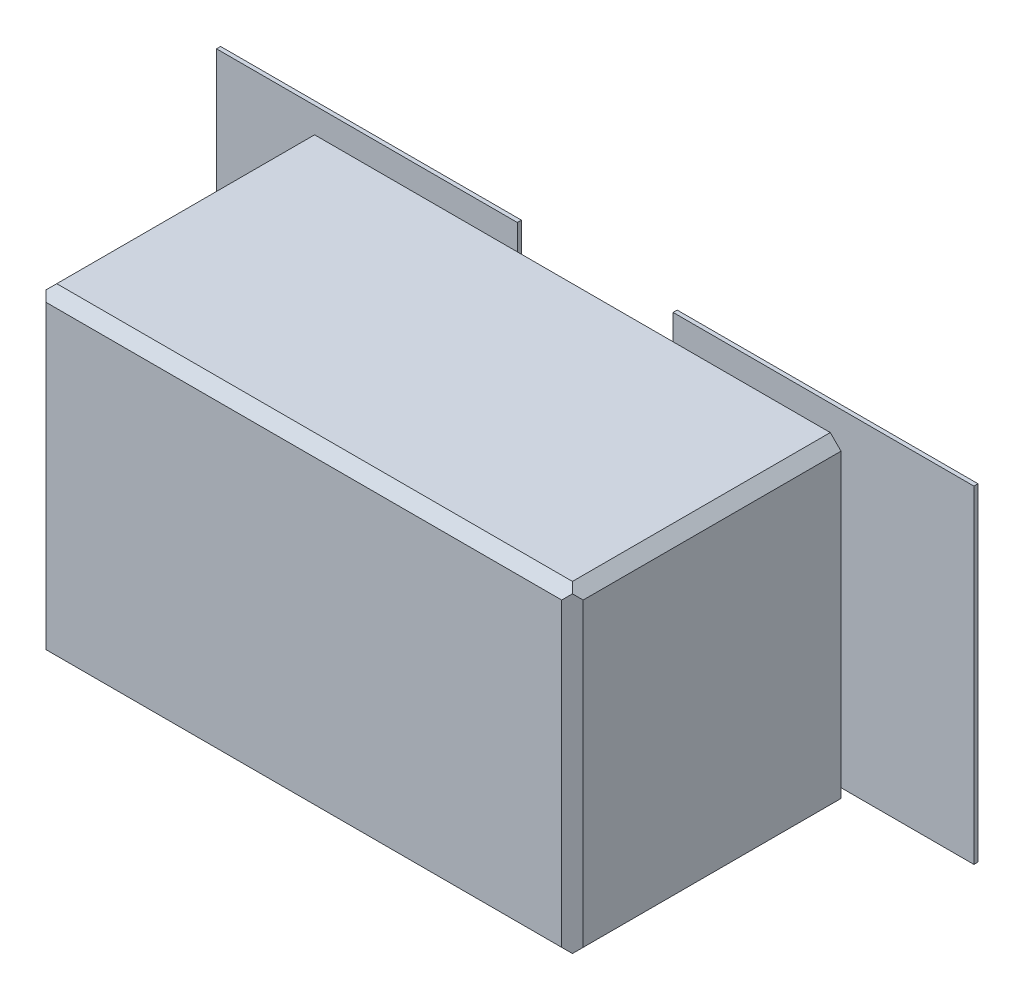
ISO-10303-21;
HEADER;
FILE_DESCRIPTION(('STEP AP214'),'2;1');
FILE_NAME('part.step','',(''),(''),'','','');
FILE_SCHEMA(('AUTOMOTIVE_DESIGN { 1 0 10303 214 1 1 1 1 }'));
ENDSEC;
DATA;
#1=APPLICATION_CONTEXT('core data for automotive mechanical design processes');
#2=APPLICATION_PROTOCOL_DEFINITION('international standard','automotive_design',2000,#1);
#3=PRODUCT_CONTEXT('',#1,'mechanical');
#4=PRODUCT('Part','Part','',(#3));
#5=PRODUCT_RELATED_PRODUCT_CATEGORY('part','',(#4));
#6=PRODUCT_DEFINITION_FORMATION('','',#4);
#7=PRODUCT_DEFINITION_CONTEXT('part definition',#1,'design');
#8=PRODUCT_DEFINITION('design','',#6,#7);
#9=PRODUCT_DEFINITION_SHAPE('','',#8);
#10=(LENGTH_UNIT() NAMED_UNIT(*) SI_UNIT(.MILLI.,.METRE.));
#11=(NAMED_UNIT(*) PLANE_ANGLE_UNIT() SI_UNIT($,.RADIAN.));
#12=(NAMED_UNIT(*) SI_UNIT($,.STERADIAN.) SOLID_ANGLE_UNIT());
#13=UNCERTAINTY_MEASURE_WITH_UNIT(LENGTH_MEASURE(1.E-05),#10,'distance_accuracy_value','');
#14=(GEOMETRIC_REPRESENTATION_CONTEXT(3) GLOBAL_UNCERTAINTY_ASSIGNED_CONTEXT((#13)) GLOBAL_UNIT_ASSIGNED_CONTEXT((#10,
#11,#12)) REPRESENTATION_CONTEXT('',''));
#15=CARTESIAN_POINT('',(0.,0.,0.));
#16=DIRECTION('',(0.,0.,1.));
#17=DIRECTION('',(1.,0.,0.));
#18=AXIS2_PLACEMENT_3D('',#15,#16,#17);
#19=CARTESIAN_POINT('',(-0.49,0.,0.6162));
#20=DIRECTION('',(-0.707106781186548,0.,0.707106781186548));
#21=DIRECTION('',(0.,1.,0.));
#22=AXIS2_PLACEMENT_3D('',#19,#20,#21);
#23=PLANE('',#22);
#24=DIRECTION('',(-0.577350269189626,0.577350269189626,-0.577350269189626));
#25=VECTOR('',#24,1.);
#26=CARTESIAN_POINT('',(-0.49,-0.29,0.6162));
#27=LINE('',#26,#25);
#28=CARTESIAN_POINT('',(-0.49,-0.29,0.6162));
#29=VERTEX_POINT('',#28);
#30=CARTESIAN_POINT('',(-0.5,-0.28,0.6062));
#31=VERTEX_POINT('',#30);
#32=EDGE_CURVE('P0_E236',#29,#31,#27,.T.);
#33=ORIENTED_EDGE('',*,*,#32,.F.);
#34=DIRECTION('',(-0.577350269189626,-0.577350269189626,-0.577350269189626));
#35=VECTOR('',#34,1.);
#36=CARTESIAN_POINT('',(-0.48,-0.28,0.6262));
#37=LINE('',#36,#35);
#38=CARTESIAN_POINT('',(-0.48,-0.28,0.6262));
#39=VERTEX_POINT('',#38);
#40=EDGE_CURVE('P0_E11',#39,#29,#37,.T.);
#41=ORIENTED_EDGE('',*,*,#40,.F.);
#42=DIRECTION('',(0.,-1.,0.));
#43=VECTOR('',#42,1.);
#44=CARTESIAN_POINT('',(-0.48,0.28,0.6262));
#45=LINE('',#44,#43);
#46=CARTESIAN_POINT('',(-0.48,0.28,0.6262));
#47=VERTEX_POINT('',#46);
#48=EDGE_CURVE('P0_E294',#47,#39,#45,.T.);
#49=ORIENTED_EDGE('',*,*,#48,.F.);
#50=DIRECTION('',(0.577350269189626,-0.577350269189626,0.577350269189626));
#51=VECTOR('',#50,1.);
#52=CARTESIAN_POINT('',(-0.49,0.29,0.6162));
#53=LINE('',#52,#51);
#54=CARTESIAN_POINT('',(-0.49,0.29,0.6162));
#55=VERTEX_POINT('',#54);
#56=EDGE_CURVE('P0_E307',#55,#47,#53,.T.);
#57=ORIENTED_EDGE('',*,*,#56,.F.);
#58=DIRECTION('',(0.577350269189626,0.577350269189626,0.577350269189626));
#59=VECTOR('',#58,1.);
#60=CARTESIAN_POINT('',(-0.5,0.28,0.6062));
#61=LINE('',#60,#59);
#62=CARTESIAN_POINT('',(-0.5,0.28,0.6062));
#63=VERTEX_POINT('',#62);
#64=EDGE_CURVE('P0_E369',#63,#55,#61,.T.);
#65=ORIENTED_EDGE('',*,*,#64,.F.);
#66=DIRECTION('',(0.,-1.,0.));
#67=VECTOR('',#66,1.);
#68=CARTESIAN_POINT('',(-0.5,0.28,0.6062));
#69=LINE('',#68,#67);
#70=EDGE_CURVE('P0_E235',#63,#31,#69,.T.);
#71=ORIENTED_EDGE('',*,*,#70,.T.);
#72=EDGE_LOOP('',(#33,#41,#49,#57,#65,#71));
#73=FACE_BOUND('',#72,.T.);
#74=ADVANCED_FACE('P0_F18',(#73),#23,.T.);
#75=CARTESIAN_POINT('',(0.,-0.29,0.6162));
#76=DIRECTION('',(0.,-0.707106781186548,0.707106781186548));
#77=DIRECTION('',(-1.,0.,0.));
#78=AXIS2_PLACEMENT_3D('',#75,#76,#77);
#79=PLANE('',#78);
#80=DIRECTION('',(-0.577350269189626,-0.577350269189626,-0.577350269189626));
#81=VECTOR('',#80,1.);
#82=CARTESIAN_POINT('',(0.49,-0.29,0.6162));
#83=LINE('',#82,#81);
#84=CARTESIAN_POINT('',(0.49,-0.29,0.6162));
#85=VERTEX_POINT('',#84);
#86=CARTESIAN_POINT('',(0.48,-0.3,0.6062));
#87=VERTEX_POINT('',#86);
#88=EDGE_CURVE('P0_E231',#85,#87,#83,.T.);
#89=ORIENTED_EDGE('',*,*,#88,.F.);
#90=DIRECTION('',(0.577350269189626,-0.577350269189626,-0.577350269189626));
#91=VECTOR('',#90,1.);
#92=CARTESIAN_POINT('',(0.48,-0.28,0.6262));
#93=LINE('',#92,#91);
#94=CARTESIAN_POINT('',(0.48,-0.28,0.6262));
#95=VERTEX_POINT('',#94);
#96=EDGE_CURVE('P0_E29',#95,#85,#93,.T.);
#97=ORIENTED_EDGE('',*,*,#96,.F.);
#98=DIRECTION('',(1.,0.,0.));
#99=VECTOR('',#98,1.);
#100=CARTESIAN_POINT('',(-0.48,-0.28,0.6262));
#101=LINE('',#100,#99);
#102=EDGE_CURVE('P0_E22',#39,#95,#101,.T.);
#103=ORIENTED_EDGE('',*,*,#102,.F.);
#104=ORIENTED_EDGE('',*,*,#40,.T.);
#105=DIRECTION('',(-0.577350269189626,0.577350269189626,0.577350269189626));
#106=VECTOR('',#105,1.);
#107=CARTESIAN_POINT('',(-0.48,-0.3,0.6062));
#108=LINE('',#107,#106);
#109=CARTESIAN_POINT('',(-0.48,-0.3,0.6062));
#110=VERTEX_POINT('',#109);
#111=EDGE_CURVE('P0_E354',#110,#29,#108,.T.);
#112=ORIENTED_EDGE('',*,*,#111,.F.);
#113=DIRECTION('',(1.,0.,0.));
#114=VECTOR('',#113,1.);
#115=CARTESIAN_POINT('',(-0.48,-0.3,0.6062));
#116=LINE('',#115,#114);
#117=EDGE_CURVE('P0_E230',#110,#87,#116,.T.);
#118=ORIENTED_EDGE('',*,*,#117,.T.);
#119=EDGE_LOOP('',(#89,#97,#103,#104,#112,#118));
#120=FACE_BOUND('',#119,.T.);
#121=ADVANCED_FACE('P0_F1008',(#120),#79,.T.);
#122=CARTESIAN_POINT('',(0.49,0.,0.6162));
#123=DIRECTION('',(0.707106781186548,0.,0.707106781186548));
#124=DIRECTION('',(0.,-1.,0.));
#125=AXIS2_PLACEMENT_3D('',#122,#123,#124);
#126=PLANE('',#125);
#127=DIRECTION('',(0.577350269189626,-0.577350269189626,-0.577350269189626));
#128=VECTOR('',#127,1.);
#129=CARTESIAN_POINT('',(0.49,0.29,0.6162));
#130=LINE('',#129,#128);
#131=CARTESIAN_POINT('',(0.49,0.29,0.6162));
#132=VERTEX_POINT('',#131);
#133=CARTESIAN_POINT('',(0.5,0.28,0.6062));
#134=VERTEX_POINT('',#133);
#135=EDGE_CURVE('P0_E310',#132,#134,#130,.T.);
#136=ORIENTED_EDGE('',*,*,#135,.F.);
#137=DIRECTION('',(0.577350269189626,0.577350269189626,-0.577350269189626));
#138=VECTOR('',#137,1.);
#139=CARTESIAN_POINT('',(0.48,0.28,0.6262));
#140=LINE('',#139,#138);
#141=CARTESIAN_POINT('',(0.48,0.28,0.6262));
#142=VERTEX_POINT('',#141);
#143=EDGE_CURVE('P0_E305',#142,#132,#140,.T.);
#144=ORIENTED_EDGE('',*,*,#143,.F.);
#145=DIRECTION('',(0.,1.,0.));
#146=VECTOR('',#145,1.);
#147=CARTESIAN_POINT('',(0.48,-0.28,0.6262));
#148=LINE('',#147,#146);
#149=EDGE_CURVE('P0_E278',#95,#142,#148,.T.);
#150=ORIENTED_EDGE('',*,*,#149,.F.);
#151=ORIENTED_EDGE('',*,*,#96,.T.);
#152=DIRECTION('',(-0.577350269189626,-0.577350269189626,0.577350269189626));
#153=VECTOR('',#152,1.);
#154=CARTESIAN_POINT('',(0.5,-0.28,0.6062));
#155=LINE('',#154,#153);
#156=CARTESIAN_POINT('',(0.5,-0.28,0.6062));
#157=VERTEX_POINT('',#156);
#158=EDGE_CURVE('P0_E266',#157,#85,#155,.T.);
#159=ORIENTED_EDGE('',*,*,#158,.F.);
#160=DIRECTION('',(0.,1.,0.));
#161=VECTOR('',#160,1.);
#162=CARTESIAN_POINT('',(0.5,-0.28,0.6062));
#163=LINE('',#162,#161);
#164=EDGE_CURVE('P0_E253',#157,#134,#163,.T.);
#165=ORIENTED_EDGE('',*,*,#164,.T.);
#166=EDGE_LOOP('',(#136,#144,#150,#151,#159,#165));
#167=FACE_BOUND('',#166,.T.);
#168=ADVANCED_FACE('P0_F1003',(#167),#126,.T.);
#169=CARTESIAN_POINT('',(0.,0.,0.6262));
#170=DIRECTION('',(0.,0.,1.));
#171=DIRECTION('',(1.,0.,0.));
#172=AXIS2_PLACEMENT_3D('',#169,#170,#171);
#173=PLANE('',#172);
#174=DIRECTION('',(-1.,0.,0.));
#175=VECTOR('',#174,1.);
#176=CARTESIAN_POINT('',(0.48,0.28,0.6262));
#177=LINE('',#176,#175);
#178=EDGE_CURVE('P0_E298',#142,#47,#177,.T.);
#179=ORIENTED_EDGE('',*,*,#178,.T.);
#180=ORIENTED_EDGE('',*,*,#48,.T.);
#181=ORIENTED_EDGE('',*,*,#102,.T.);
#182=ORIENTED_EDGE('',*,*,#149,.T.);
#183=EDGE_LOOP('',(#179,#180,#181,#182));
#184=FACE_BOUND('',#183,.T.);
#185=ADVANCED_FACE('P0_F857',(#184),#173,.T.);
#186=CARTESIAN_POINT('',(0.,0.29,0.6162));
#187=DIRECTION('',(0.,0.707106781186548,0.707106781186548));
#188=DIRECTION('',(1.,0.,0.));
#189=AXIS2_PLACEMENT_3D('',#186,#187,#188);
#190=PLANE('',#189);
#191=ORIENTED_EDGE('',*,*,#143,.T.);
#192=DIRECTION('',(0.577350269189626,-0.577350269189626,0.577350269189626));
#193=VECTOR('',#192,1.);
#194=CARTESIAN_POINT('',(0.48,0.3,0.6062));
#195=LINE('',#194,#193);
#196=CARTESIAN_POINT('',(0.48,0.3,0.6062));
#197=VERTEX_POINT('',#196);
#198=EDGE_CURVE('P0_E314',#197,#132,#195,.T.);
#199=ORIENTED_EDGE('',*,*,#198,.F.);
#200=DIRECTION('',(-1.,0.,0.));
#201=VECTOR('',#200,1.);
#202=CARTESIAN_POINT('',(0.48,0.3,0.6062));
#203=LINE('',#202,#201);
#204=CARTESIAN_POINT('',(-0.48,0.3,0.6062));
#205=VERTEX_POINT('',#204);
#206=EDGE_CURVE('P0_E308',#197,#205,#203,.T.);
#207=ORIENTED_EDGE('',*,*,#206,.T.);
#208=DIRECTION('',(-0.577350269189626,-0.577350269189626,0.577350269189626));
#209=VECTOR('',#208,1.);
#210=CARTESIAN_POINT('',(-0.48,0.3,0.6062));
#211=LINE('',#210,#209);
#212=EDGE_CURVE('P0_E343',#205,#55,#211,.T.);
#213=ORIENTED_EDGE('',*,*,#212,.T.);
#214=ORIENTED_EDGE('',*,*,#56,.T.);
#215=ORIENTED_EDGE('',*,*,#178,.F.);
#216=EDGE_LOOP('',(#191,#199,#207,#213,#214,#215));
#217=FACE_BOUND('',#216,.T.);
#218=ADVANCED_FACE('P0_F850',(#217),#190,.T.);
#219=CARTESIAN_POINT('',(0.5,0.3,0.0762));
#220=DIRECTION('',(0.,1.,0.));
#221=DIRECTION('',(1.,0.,0.));
#222=AXIS2_PLACEMENT_3D('',#219,#220,#221);
#223=PLANE('',#222);
#224=DIRECTION('',(-1.,0.,0.));
#225=VECTOR('',#224,1.);
#226=CARTESIAN_POINT('',(0.48,0.3,0.1262));
#227=LINE('',#226,#225);
#228=CARTESIAN_POINT('',(0.48,0.3,0.1262));
#229=VERTEX_POINT('',#228);
#230=CARTESIAN_POINT('',(-0.48,0.3,0.1262));
#231=VERTEX_POINT('',#230);
#232=EDGE_CURVE('P0_E318',#229,#231,#227,.T.);
#233=ORIENTED_EDGE('',*,*,#232,.T.);
#234=DIRECTION('',(0.,0.,-1.));
#235=VECTOR('',#234,1.);
#236=CARTESIAN_POINT('',(-0.48,0.3,0.6062));
#237=LINE('',#236,#235);
#238=EDGE_CURVE('P0_E339',#205,#231,#237,.T.);
#239=ORIENTED_EDGE('',*,*,#238,.F.);
#240=ORIENTED_EDGE('',*,*,#206,.F.);
#241=DIRECTION('',(0.,0.,-1.));
#242=VECTOR('',#241,1.);
#243=CARTESIAN_POINT('',(0.48,0.3,0.6062));
#244=LINE('',#243,#242);
#245=EDGE_CURVE('P0_E252',#197,#229,#244,.T.);
#246=ORIENTED_EDGE('',*,*,#245,.T.);
#247=EDGE_LOOP('',(#233,#239,#240,#246));
#248=FACE_BOUND('',#247,.T.);
#249=ADVANCED_FACE('P0_F856',(#248),#223,.T.);
#250=CARTESIAN_POINT('',(-0.49,0.29,0.3762));
#251=DIRECTION('',(-0.707106781186548,0.707106781186548,0.));
#252=DIRECTION('',(0.,0.,1.));
#253=AXIS2_PLACEMENT_3D('',#250,#251,#252);
#254=PLANE('',#253);
#255=DIRECTION('',(0.,0.,-1.));
#256=VECTOR('',#255,1.);
#257=CARTESIAN_POINT('',(-0.5,0.28,0.6062));
#258=LINE('',#257,#256);
#259=CARTESIAN_POINT('',(-0.5,0.28,0.1262));
#260=VERTEX_POINT('',#259);
#261=EDGE_CURVE('P0_E373',#63,#260,#258,.T.);
#262=ORIENTED_EDGE('',*,*,#261,.F.);
#263=ORIENTED_EDGE('',*,*,#64,.T.);
#264=ORIENTED_EDGE('',*,*,#212,.F.);
#265=ORIENTED_EDGE('',*,*,#238,.T.);
#266=DIRECTION('',(0.707106781186548,0.707106781186548,0.));
#267=VECTOR('',#266,1.);
#268=CARTESIAN_POINT('',(-0.5,0.28,0.1262));
#269=LINE('',#268,#267);
#270=EDGE_CURVE('P0_E322',#260,#231,#269,.T.);
#271=ORIENTED_EDGE('',*,*,#270,.F.);
#272=EDGE_LOOP('',(#262,#263,#264,#265,#271));
#273=FACE_BOUND('',#272,.T.);
#274=ADVANCED_FACE('P0_F495',(#273),#254,.T.);
#275=CARTESIAN_POINT('',(-0.5,0.3,0.0762));
#276=DIRECTION('',(-1.,0.,0.));
#277=DIRECTION('',(0.,0.,1.));
#278=AXIS2_PLACEMENT_3D('',#275,#276,#277);
#279=PLANE('',#278);
#280=ORIENTED_EDGE('',*,*,#70,.F.);
#281=ORIENTED_EDGE('',*,*,#261,.T.);
#282=DIRECTION('',(0.,-1.,0.));
#283=VECTOR('',#282,1.);
#284=CARTESIAN_POINT('',(-0.5,0.28,0.1262));
#285=LINE('',#284,#283);
#286=CARTESIAN_POINT('',(-0.5,-0.28,0.1262));
#287=VERTEX_POINT('',#286);
#288=EDGE_CURVE('P0_E365',#260,#287,#285,.T.);
#289=ORIENTED_EDGE('',*,*,#288,.T.);
#290=DIRECTION('',(0.,0.,-1.));
#291=VECTOR('',#290,1.);
#292=CARTESIAN_POINT('',(-0.5,-0.28,0.6062));
#293=LINE('',#292,#291);
#294=EDGE_CURVE('P0_E232',#31,#287,#293,.T.);
#295=ORIENTED_EDGE('',*,*,#294,.F.);
#296=EDGE_LOOP('',(#280,#281,#289,#295));
#297=FACE_BOUND('',#296,.T.);
#298=ADVANCED_FACE('P0_F491',(#297),#279,.T.);
#299=CARTESIAN_POINT('',(-0.49,-0.29,0.3762));
#300=DIRECTION('',(-0.707106781186548,-0.707106781186548,0.));
#301=DIRECTION('',(-0.707106781186548,0.707106781186548,0.));
#302=AXIS2_PLACEMENT_3D('',#299,#300,#301);
#303=PLANE('',#302);
#304=DIRECTION('',(0.,0.,-1.));
#305=VECTOR('',#304,1.);
#306=CARTESIAN_POINT('',(-0.48,-0.3,0.6062));
#307=LINE('',#306,#305);
#308=CARTESIAN_POINT('',(-0.48,-0.3,0.1262));
#309=VERTEX_POINT('',#308);
#310=EDGE_CURVE('P0_E249',#110,#309,#307,.T.);
#311=ORIENTED_EDGE('',*,*,#310,.F.);
#312=ORIENTED_EDGE('',*,*,#111,.T.);
#313=ORIENTED_EDGE('',*,*,#32,.T.);
#314=ORIENTED_EDGE('',*,*,#294,.T.);
#315=DIRECTION('',(-0.707106781186548,0.707106781186548,0.));
#316=VECTOR('',#315,1.);
#317=CARTESIAN_POINT('',(-0.48,-0.3,0.1262));
#318=LINE('',#317,#316);
#319=EDGE_CURVE('P0_E262',#309,#287,#318,.T.);
#320=ORIENTED_EDGE('',*,*,#319,.F.);
#321=EDGE_LOOP('',(#311,#312,#313,#314,#320));
#322=FACE_BOUND('',#321,.T.);
#323=ADVANCED_FACE('P0_F880',(#322),#303,.T.);
#324=CARTESIAN_POINT('',(-0.5,-0.3,0.0762));
#325=DIRECTION('',(0.,-1.,0.));
#326=DIRECTION('',(0.,0.,-1.));
#327=AXIS2_PLACEMENT_3D('',#324,#325,#326);
#328=PLANE('',#327);
#329=ORIENTED_EDGE('',*,*,#117,.F.);
#330=ORIENTED_EDGE('',*,*,#310,.T.);
#331=DIRECTION('',(1.,0.,0.));
#332=VECTOR('',#331,1.);
#333=CARTESIAN_POINT('',(-0.48,-0.3,0.1262));
#334=LINE('',#333,#332);
#335=CARTESIAN_POINT('',(0.48,-0.3,0.1262));
#336=VERTEX_POINT('',#335);
#337=EDGE_CURVE('P0_E258',#309,#336,#334,.T.);
#338=ORIENTED_EDGE('',*,*,#337,.T.);
#339=DIRECTION('',(0.,0.,-1.));
#340=VECTOR('',#339,1.);
#341=CARTESIAN_POINT('',(0.48,-0.3,0.6062));
#342=LINE('',#341,#340);
#343=EDGE_CURVE('P0_E227',#87,#336,#342,.T.);
#344=ORIENTED_EDGE('',*,*,#343,.F.);
#345=EDGE_LOOP('',(#329,#330,#338,#344));
#346=FACE_BOUND('',#345,.T.);
#347=ADVANCED_FACE('P0_F885',(#346),#328,.T.);
#348=CARTESIAN_POINT('',(0.49,-0.29,0.3762));
#349=DIRECTION('',(0.707106781186548,-0.707106781186548,0.));
#350=DIRECTION('',(0.,0.,-1.));
#351=AXIS2_PLACEMENT_3D('',#348,#349,#350);
#352=PLANE('',#351);
#353=DIRECTION('',(0.,0.,-1.));
#354=VECTOR('',#353,1.);
#355=CARTESIAN_POINT('',(0.5,-0.28,0.6062));
#356=LINE('',#355,#354);
#357=CARTESIAN_POINT('',(0.5,-0.28,0.1262));
#358=VERTEX_POINT('',#357);
#359=EDGE_CURVE('P0_E256',#157,#358,#356,.T.);
#360=ORIENTED_EDGE('',*,*,#359,.F.);
#361=ORIENTED_EDGE('',*,*,#158,.T.);
#362=ORIENTED_EDGE('',*,*,#88,.T.);
#363=ORIENTED_EDGE('',*,*,#343,.T.);
#364=DIRECTION('',(-0.707106781186548,-0.707106781186548,0.));
#365=VECTOR('',#364,1.);
#366=CARTESIAN_POINT('',(0.5,-0.28,0.1262));
#367=LINE('',#366,#365);
#368=EDGE_CURVE('P0_E263',#358,#336,#367,.T.);
#369=ORIENTED_EDGE('',*,*,#368,.F.);
#370=EDGE_LOOP('',(#360,#361,#362,#363,#369));
#371=FACE_BOUND('',#370,.T.);
#372=ADVANCED_FACE('P0_F411',(#371),#352,.T.);
#373=CARTESIAN_POINT('',(0.5,-0.3,0.0762));
#374=DIRECTION('',(1.,0.,0.));
#375=DIRECTION('',(0.,1.,0.));
#376=AXIS2_PLACEMENT_3D('',#373,#374,#375);
#377=PLANE('',#376);
#378=ORIENTED_EDGE('',*,*,#164,.F.);
#379=ORIENTED_EDGE('',*,*,#359,.T.);
#380=DIRECTION('',(0.,1.,0.));
#381=VECTOR('',#380,1.);
#382=CARTESIAN_POINT('',(0.5,-0.28,0.1262));
#383=LINE('',#382,#381);
#384=CARTESIAN_POINT('',(0.5,0.28,0.1262));
#385=VERTEX_POINT('',#384);
#386=EDGE_CURVE('P0_E267',#358,#385,#383,.T.);
#387=ORIENTED_EDGE('',*,*,#386,.T.);
#388=DIRECTION('',(0.,0.,-1.));
#389=VECTOR('',#388,1.);
#390=CARTESIAN_POINT('',(0.5,0.28,0.6062));
#391=LINE('',#390,#389);
#392=EDGE_CURVE('P0_E257',#134,#385,#391,.T.);
#393=ORIENTED_EDGE('',*,*,#392,.F.);
#394=EDGE_LOOP('',(#378,#379,#387,#393));
#395=FACE_BOUND('',#394,.T.);
#396=ADVANCED_FACE('P0_F406',(#395),#377,.T.);
#397=CARTESIAN_POINT('',(0.49,0.29,0.3762));
#398=DIRECTION('',(0.707106781186548,0.707106781186548,0.));
#399=DIRECTION('',(0.,0.,-1.));
#400=AXIS2_PLACEMENT_3D('',#397,#398,#399);
#401=PLANE('',#400);
#402=ORIENTED_EDGE('',*,*,#245,.F.);
#403=ORIENTED_EDGE('',*,*,#198,.T.);
#404=ORIENTED_EDGE('',*,*,#135,.T.);
#405=ORIENTED_EDGE('',*,*,#392,.T.);
#406=DIRECTION('',(0.707106781186498,-0.707106781186597,0.));
#407=VECTOR('',#406,1.);
#408=CARTESIAN_POINT('',(0.48,0.3,0.1262));
#409=LINE('',#408,#407);
#410=EDGE_CURVE('P0_E225',#229,#385,#409,.T.);
#411=ORIENTED_EDGE('',*,*,#410,.F.);
#412=EDGE_LOOP('',(#402,#403,#404,#405,#411));
#413=FACE_BOUND('',#412,.T.);
#414=ADVANCED_FACE('P0_F919',(#413),#401,.T.);
#415=CARTESIAN_POINT('',(-0.4659973957868,-0.25,0.1262));
#416=DIRECTION('',(-1.,0.,0.));
#417=DIRECTION('',(0.,0.,1.));
#418=AXIS2_PLACEMENT_3D('',#415,#416,#417);
#419=PLANE('',#418);
#420=DIRECTION('',(0.,0.,-1.));
#421=VECTOR('',#420,1.);
#422=CARTESIAN_POINT('',(-0.4659973957868,0.2,0.1262));
#423=LINE('',#422,#421);
#424=CARTESIAN_POINT('',(-0.4659973957868,0.2,0.1262));
#425=VERTEX_POINT('',#424);
#426=CARTESIAN_POINT('',(-0.4659973957868,0.2,0.0862));
#427=VERTEX_POINT('',#426);
#428=EDGE_CURVE('P0_E245',#425,#427,#423,.T.);
#429=ORIENTED_EDGE('',*,*,#428,.T.);
#430=DIRECTION('',(0.,1.,0.));
#431=VECTOR('',#430,1.);
#432=CARTESIAN_POINT('',(-0.4659973957868,-0.25,0.0862));
#433=LINE('',#432,#431);
#434=CARTESIAN_POINT('',(-0.4659973957868,-0.25,0.0862));
#435=VERTEX_POINT('',#434);
#436=EDGE_CURVE('P0_E281',#435,#427,#433,.T.);
#437=ORIENTED_EDGE('',*,*,#436,.F.);
#438=DIRECTION('',(0.,0.,-1.));
#439=VECTOR('',#438,1.);
#440=CARTESIAN_POINT('',(-0.4659973957868,-0.25,0.1262));
#441=LINE('',#440,#439);
#442=CARTESIAN_POINT('',(-0.4659973957868,-0.25,0.1262));
#443=VERTEX_POINT('',#442);
#444=EDGE_CURVE('P0_E237',#443,#435,#441,.T.);
#445=ORIENTED_EDGE('',*,*,#444,.F.);
#446=DIRECTION('',(0.,1.,0.));
#447=VECTOR('',#446,1.);
#448=CARTESIAN_POINT('',(-0.4659973957868,-0.25,0.1262));
#449=LINE('',#448,#447);
#450=EDGE_CURVE('P0_E287',#443,#425,#449,.T.);
#451=ORIENTED_EDGE('',*,*,#450,.T.);
#452=EDGE_LOOP('',(#429,#437,#445,#451));
#453=FACE_BOUND('',#452,.T.);
#454=ADVANCED_FACE('P0_F924',(#453),#419,.T.);
#455=CARTESIAN_POINT('',(-0.4659973957868,0.25,0.1262));
#456=DIRECTION('',(0.,0.,-1.));
#457=DIRECTION('',(-1.,0.,0.));
#458=AXIS2_PLACEMENT_3D('',#455,#456,#457);
#459=CYLINDRICAL_SURFACE('',#458,0.05);
#460=DIRECTION('',(0.,0.,-1.));
#461=VECTOR('',#460,1.);
#462=CARTESIAN_POINT('',(-0.4159973957868,0.25,0.1262));
#463=LINE('',#462,#461);
#464=CARTESIAN_POINT('',(-0.4159973957868,0.25,0.1262));
#465=VERTEX_POINT('',#464);
#466=CARTESIAN_POINT('',(-0.4159973957868,0.25,0.0862));
#467=VERTEX_POINT('',#466);
#468=EDGE_CURVE('P0_E242',#465,#467,#463,.T.);
#469=ORIENTED_EDGE('',*,*,#468,.T.);
#470=CARTESIAN_POINT('',(-0.4659973957868,0.25,0.0862));
#471=DIRECTION('',(0.,0.,1.));
#472=DIRECTION('',(0.,-1.,0.));
#473=AXIS2_PLACEMENT_3D('',#470,#471,#472);
#474=CIRCLE('',#473,0.05);
#475=EDGE_CURVE('P0_E304',#427,#467,#474,.T.);
#476=ORIENTED_EDGE('',*,*,#475,.F.);
#477=ORIENTED_EDGE('',*,*,#428,.F.);
#478=CARTESIAN_POINT('',(-0.4659973957868,0.25,0.1262));
#479=DIRECTION('',(0.,0.,-1.));
#480=DIRECTION('',(1.,0.,0.));
#481=AXIS2_PLACEMENT_3D('',#478,#479,#480);
#482=CIRCLE('',#481,0.05);
#483=EDGE_CURVE('P0_E293',#465,#425,#482,.T.);
#484=ORIENTED_EDGE('',*,*,#483,.F.);
#485=EDGE_LOOP('',(#469,#476,#477,#484));
#486=FACE_BOUND('',#485,.T.);
#487=ADVANCED_FACE('P0_F936',(#486),#459,.F.);
#488=CARTESIAN_POINT('',(-0.4159973957868,0.25,0.1262));
#489=DIRECTION('',(0.,1.,0.));
#490=DIRECTION('',(1.,0.,0.));
#491=AXIS2_PLACEMENT_3D('',#488,#489,#490);
#492=PLANE('',#491);
#493=DIRECTION('',(0.,0.,-1.));
#494=VECTOR('',#493,1.);
#495=CARTESIAN_POINT('',(-0.2159973957868,0.25,0.1262));
#496=LINE('',#495,#494);
#497=CARTESIAN_POINT('',(-0.2159973957868,0.25,0.1262));
#498=VERTEX_POINT('',#497);
#499=CARTESIAN_POINT('',(-0.2159973957868,0.25,0.0862));
#500=VERTEX_POINT('',#499);
#501=EDGE_CURVE('P0_E246',#498,#500,#496,.T.);
#502=ORIENTED_EDGE('',*,*,#501,.T.);
#503=DIRECTION('',(1.,0.,0.));
#504=VECTOR('',#503,1.);
#505=CARTESIAN_POINT('',(-0.4159973957868,0.25,0.0862));
#506=LINE('',#505,#504);
#507=EDGE_CURVE('P0_E299',#467,#500,#506,.T.);
#508=ORIENTED_EDGE('',*,*,#507,.F.);
#509=ORIENTED_EDGE('',*,*,#468,.F.);
#510=DIRECTION('',(1.,0.,0.));
#511=VECTOR('',#510,1.);
#512=CARTESIAN_POINT('',(-0.4159973957868,0.25,0.1262));
#513=LINE('',#512,#511);
#514=EDGE_CURVE('P0_E378',#465,#498,#513,.T.);
#515=ORIENTED_EDGE('',*,*,#514,.T.);
#516=EDGE_LOOP('',(#502,#508,#509,#515));
#517=FACE_BOUND('',#516,.T.);
#518=ADVANCED_FACE('P0_F899',(#517),#492,.T.);
#519=CARTESIAN_POINT('',(-0.2159973957868,0.25,0.1262));
#520=DIRECTION('',(1.,0.,0.));
#521=DIRECTION('',(0.,1.,0.));
#522=AXIS2_PLACEMENT_3D('',#519,#520,#521);
#523=PLANE('',#522);
#524=DIRECTION('',(0.,0.,-1.));
#525=VECTOR('',#524,1.);
#526=CARTESIAN_POINT('',(-0.2159973957868,-0.25,0.1262));
#527=LINE('',#526,#525);
#528=CARTESIAN_POINT('',(-0.2159973957868,-0.25,0.1262));
#529=VERTEX_POINT('',#528);
#530=CARTESIAN_POINT('',(-0.2159973957868,-0.25,0.0862));
#531=VERTEX_POINT('',#530);
#532=EDGE_CURVE('P0_E272',#529,#531,#527,.T.);
#533=ORIENTED_EDGE('',*,*,#532,.T.);
#534=DIRECTION('',(0.,-1.,0.));
#535=VECTOR('',#534,1.);
#536=CARTESIAN_POINT('',(-0.2159973957868,0.25,0.0862));
#537=LINE('',#536,#535);
#538=EDGE_CURVE('P0_E303',#500,#531,#537,.T.);
#539=ORIENTED_EDGE('',*,*,#538,.F.);
#540=ORIENTED_EDGE('',*,*,#501,.F.);
#541=DIRECTION('',(0.,-1.,0.));
#542=VECTOR('',#541,1.);
#543=CARTESIAN_POINT('',(-0.2159973957868,0.25,0.1262));
#544=LINE('',#543,#542);
#545=EDGE_CURVE('P0_E282',#498,#529,#544,.T.);
#546=ORIENTED_EDGE('',*,*,#545,.T.);
#547=EDGE_LOOP('',(#533,#539,#540,#546));
#548=FACE_BOUND('',#547,.T.);
#549=ADVANCED_FACE('P0_F428',(#548),#523,.T.);
#550=CARTESIAN_POINT('',(0.,0.,0.0862));
#551=DIRECTION('',(0.,0.,-1.));
#552=DIRECTION('',(0.,-1.,0.));
#553=AXIS2_PLACEMENT_3D('',#550,#551,#552);
#554=PLANE('',#553);
#555=DIRECTION('',(-1.,0.,0.));
#556=VECTOR('',#555,1.);
#557=CARTESIAN_POINT('',(-0.2159973957868,-0.25,0.0862));
#558=LINE('',#557,#556);
#559=EDGE_CURVE('P0_E241',#531,#435,#558,.T.);
#560=ORIENTED_EDGE('',*,*,#559,.T.);
#561=ORIENTED_EDGE('',*,*,#436,.T.);
#562=ORIENTED_EDGE('',*,*,#475,.T.);
#563=ORIENTED_EDGE('',*,*,#507,.T.);
#564=ORIENTED_EDGE('',*,*,#538,.T.);
#565=EDGE_LOOP('',(#560,#561,#562,#563,#564));
#566=FACE_BOUND('',#565,.T.);
#567=ADVANCED_FACE('P0_F898',(#566),#554,.T.);
#568=CARTESIAN_POINT('',(0.,0.,0.0862));
#569=DIRECTION('',(0.,0.,-1.));
#570=DIRECTION('',(0.,-1.,0.));
#571=AXIS2_PLACEMENT_3D('',#568,#569,#570);
#572=PLANE('',#571);
#573=DIRECTION('',(-1.,0.,0.));
#574=VECTOR('',#573,1.);
#575=CARTESIAN_POINT('',(0.4340026042132,-0.25,0.0862));
#576=LINE('',#575,#574);
#577=CARTESIAN_POINT('',(0.4340026042132,-0.25,0.0862));
#578=VERTEX_POINT('',#577);
#579=CARTESIAN_POINT('',(0.1840026042132,-0.25,0.0862));
#580=VERTEX_POINT('',#579);
#581=EDGE_CURVE('P0_E194',#578,#580,#576,.T.);
#582=ORIENTED_EDGE('',*,*,#581,.T.);
#583=DIRECTION('',(0.,1.,0.));
#584=VECTOR('',#583,1.);
#585=CARTESIAN_POINT('',(0.1840026042132,-0.25,0.0862));
#586=LINE('',#585,#584);
#587=CARTESIAN_POINT('',(0.1840026042132,0.25,0.0862));
#588=VERTEX_POINT('',#587);
#589=EDGE_CURVE('P0_E187',#580,#588,#586,.T.);
#590=ORIENTED_EDGE('',*,*,#589,.T.);
#591=DIRECTION('',(1.,0.,0.));
#592=VECTOR('',#591,1.);
#593=CARTESIAN_POINT('',(0.1840026042132,0.25,0.0862));
#594=LINE('',#593,#592);
#595=CARTESIAN_POINT('',(0.4340026042132,0.25,0.0862));
#596=VERTEX_POINT('',#595);
#597=EDGE_CURVE('P0_E192',#588,#596,#594,.T.);
#598=ORIENTED_EDGE('',*,*,#597,.T.);
#599=DIRECTION('',(0.,-1.,0.));
#600=VECTOR('',#599,1.);
#601=CARTESIAN_POINT('',(0.4340026042132,0.25,0.0862));
#602=LINE('',#601,#600);
#603=EDGE_CURVE('P0_E221',#596,#578,#602,.T.);
#604=ORIENTED_EDGE('',*,*,#603,.T.);
#605=EDGE_LOOP('',(#582,#590,#598,#604));
#606=FACE_BOUND('',#605,.T.);
#607=ADVANCED_FACE('P0_F189',(#606),#572,.T.);
#608=CARTESIAN_POINT('',(0.4340026042132,-0.25,0.1262));
#609=DIRECTION('',(0.,-1.,0.));
#610=DIRECTION('',(0.,0.,-1.));
#611=AXIS2_PLACEMENT_3D('',#608,#609,#610);
#612=PLANE('',#611);
#613=DIRECTION('',(0.,0.,-1.));
#614=VECTOR('',#613,1.);
#615=CARTESIAN_POINT('',(0.1840026042132,-0.25,0.1262));
#616=LINE('',#615,#614);
#617=CARTESIAN_POINT('',(0.1840026042132,-0.25,0.1262));
#618=VERTEX_POINT('',#617);
#619=EDGE_CURVE('P0_E198',#618,#580,#616,.T.);
#620=ORIENTED_EDGE('',*,*,#619,.T.);
#621=ORIENTED_EDGE('',*,*,#581,.F.);
#622=DIRECTION('',(0.,0.,-1.));
#623=VECTOR('',#622,1.);
#624=CARTESIAN_POINT('',(0.4340026042132,-0.25,0.1262));
#625=LINE('',#624,#623);
#626=CARTESIAN_POINT('',(0.4340026042132,-0.25,0.1262));
#627=VERTEX_POINT('',#626);
#628=EDGE_CURVE('P0_E325',#627,#578,#625,.T.);
#629=ORIENTED_EDGE('',*,*,#628,.F.);
#630=DIRECTION('',(-1.,0.,0.));
#631=VECTOR('',#630,1.);
#632=CARTESIAN_POINT('',(0.4340026042132,-0.25,0.1262));
#633=LINE('',#632,#631);
#634=EDGE_CURVE('P0_E326',#627,#618,#633,.T.);
#635=ORIENTED_EDGE('',*,*,#634,.T.);
#636=EDGE_LOOP('',(#620,#621,#629,#635));
#637=FACE_BOUND('',#636,.T.);
#638=ADVANCED_FACE('P0_F20',(#637),#612,.T.);
#639=CARTESIAN_POINT('',(0.1840026042132,-0.25,0.1262));
#640=DIRECTION('',(-1.,0.,0.));
#641=DIRECTION('',(0.,0.,1.));
#642=AXIS2_PLACEMENT_3D('',#639,#640,#641);
#643=PLANE('',#642);
#644=DIRECTION('',(0.,0.,-1.));
#645=VECTOR('',#644,1.);
#646=CARTESIAN_POINT('',(0.1840026042132,0.25,0.1262));
#647=LINE('',#646,#645);
#648=CARTESIAN_POINT('',(0.1840026042132,0.25,0.1262));
#649=VERTEX_POINT('',#648);
#650=EDGE_CURVE('P0_E199',#649,#588,#647,.T.);
#651=ORIENTED_EDGE('',*,*,#650,.T.);
#652=ORIENTED_EDGE('',*,*,#589,.F.);
#653=ORIENTED_EDGE('',*,*,#619,.F.);
#654=DIRECTION('',(0.,1.,0.));
#655=VECTOR('',#654,1.);
#656=CARTESIAN_POINT('',(0.1840026042132,-0.25,0.1262));
#657=LINE('',#656,#655);
#658=EDGE_CURVE('P0_E204',#618,#649,#657,.T.);
#659=ORIENTED_EDGE('',*,*,#658,.T.);
#660=EDGE_LOOP('',(#651,#652,#653,#659));
#661=FACE_BOUND('',#660,.T.);
#662=ADVANCED_FACE('P0_F202',(#661),#643,.T.);
#663=CARTESIAN_POINT('',(0.1840026042132,0.25,0.1262));
#664=DIRECTION('',(0.,1.,0.));
#665=DIRECTION('',(1.,0.,0.));
#666=AXIS2_PLACEMENT_3D('',#663,#664,#665);
#667=PLANE('',#666);
#668=DIRECTION('',(0.,0.,-1.));
#669=VECTOR('',#668,1.);
#670=CARTESIAN_POINT('',(0.4340026042132,0.25,0.1262));
#671=LINE('',#670,#669);
#672=CARTESIAN_POINT('',(0.4340026042132,0.25,0.1262));
#673=VERTEX_POINT('',#672);
#674=EDGE_CURVE('P0_E211',#673,#596,#671,.T.);
#675=ORIENTED_EDGE('',*,*,#674,.T.);
#676=ORIENTED_EDGE('',*,*,#597,.F.);
#677=ORIENTED_EDGE('',*,*,#650,.F.);
#678=DIRECTION('',(1.,0.,0.));
#679=VECTOR('',#678,1.);
#680=CARTESIAN_POINT('',(0.1840026042132,0.25,0.1262));
#681=LINE('',#680,#679);
#682=EDGE_CURVE('P0_E286',#649,#673,#681,.T.);
#683=ORIENTED_EDGE('',*,*,#682,.T.);
#684=EDGE_LOOP('',(#675,#676,#677,#683));
#685=FACE_BOUND('',#684,.T.);
#686=ADVANCED_FACE('P0_F210',(#685),#667,.T.);
#687=CARTESIAN_POINT('',(0.4340026042132,0.25,0.1262));
#688=DIRECTION('',(1.,0.,0.));
#689=DIRECTION('',(0.,1.,0.));
#690=AXIS2_PLACEMENT_3D('',#687,#688,#689);
#691=PLANE('',#690);
#692=ORIENTED_EDGE('',*,*,#628,.T.);
#693=ORIENTED_EDGE('',*,*,#603,.F.);
#694=ORIENTED_EDGE('',*,*,#674,.F.);
#695=DIRECTION('',(0.,-1.,0.));
#696=VECTOR('',#695,1.);
#697=CARTESIAN_POINT('',(0.4340026042132,0.25,0.1262));
#698=LINE('',#697,#696);
#699=EDGE_CURVE('P0_E330',#673,#627,#698,.T.);
#700=ORIENTED_EDGE('',*,*,#699,.T.);
#701=EDGE_LOOP('',(#692,#693,#694,#700));
#702=FACE_BOUND('',#701,.T.);
#703=ADVANCED_FACE('P0_F473',(#702),#691,.T.);
#704=CARTESIAN_POINT('',(0.,0.,0.1262));
#705=DIRECTION('',(0.,0.,1.));
#706=DIRECTION('',(1.,0.,0.));
#707=AXIS2_PLACEMENT_3D('',#704,#705,#706);
#708=PLANE('',#707);
#709=ORIENTED_EDGE('',*,*,#682,.F.);
#710=ORIENTED_EDGE('',*,*,#658,.F.);
#711=ORIENTED_EDGE('',*,*,#634,.F.);
#712=ORIENTED_EDGE('',*,*,#699,.F.);
#713=EDGE_LOOP('',(#709,#710,#711,#712));
#714=FACE_BOUND('',#713,.T.);
#715=ORIENTED_EDGE('',*,*,#514,.F.);
#716=ORIENTED_EDGE('',*,*,#483,.T.);
#717=ORIENTED_EDGE('',*,*,#450,.F.);
#718=DIRECTION('',(-1.,0.,0.));
#719=VECTOR('',#718,1.);
#720=CARTESIAN_POINT('',(-0.2159973957868,-0.25,0.1262));
#721=LINE('',#720,#719);
#722=EDGE_CURVE('P0_E271',#529,#443,#721,.T.);
#723=ORIENTED_EDGE('',*,*,#722,.F.);
#724=ORIENTED_EDGE('',*,*,#545,.F.);
#725=EDGE_LOOP('',(#715,#716,#717,#723,#724));
#726=FACE_BOUND('',#725,.T.);
#727=ORIENTED_EDGE('',*,*,#386,.F.);
#728=ORIENTED_EDGE('',*,*,#368,.T.);
#729=ORIENTED_EDGE('',*,*,#337,.F.);
#730=ORIENTED_EDGE('',*,*,#319,.T.);
#731=ORIENTED_EDGE('',*,*,#288,.F.);
#732=ORIENTED_EDGE('',*,*,#270,.T.);
#733=ORIENTED_EDGE('',*,*,#232,.F.);
#734=ORIENTED_EDGE('',*,*,#410,.T.);
#735=EDGE_LOOP('',(#727,#728,#729,#730,#731,#732,#733,#734));
#736=FACE_BOUND('',#735,.T.);
#737=ADVANCED_FACE('P0_F398',(#714,#726,#736),#708,.F.);
#738=CARTESIAN_POINT('',(-0.2159973957868,-0.25,0.1262));
#739=DIRECTION('',(0.,-1.,0.));
#740=DIRECTION('',(0.,0.,-1.));
#741=AXIS2_PLACEMENT_3D('',#738,#739,#740);
#742=PLANE('',#741);
#743=ORIENTED_EDGE('',*,*,#444,.T.);
#744=ORIENTED_EDGE('',*,*,#559,.F.);
#745=ORIENTED_EDGE('',*,*,#532,.F.);
#746=ORIENTED_EDGE('',*,*,#722,.T.);
#747=EDGE_LOOP('',(#743,#744,#745,#746));
#748=FACE_BOUND('',#747,.T.);
#749=ADVANCED_FACE('P0_F435',(#748),#742,.T.);
#750=CLOSED_SHELL('',(#74,#121,#168,#185,#218,#249,#274,#298,#323,#347,#372,#396,#414,#454,#487,
#518,#549,#567,#607,#638,#662,#686,#703,#737,#749));
#751=MANIFOLD_SOLID_BREP('P0_B1',#750);
#752=CARTESIAN_POINT('',(0.,0.,0.08382));
#753=DIRECTION('',(0.,0.,1.));
#754=DIRECTION('',(1.,0.,0.));
#755=AXIS2_PLACEMENT_3D('',#752,#753,#754);
#756=PLANE('',#755);
#757=DIRECTION('',(0.,1.,0.));
#758=VECTOR('',#757,1.);
#759=CARTESIAN_POINT('',(-0.145,-0.305,0.08382));
#760=LINE('',#759,#758);
#761=CARTESIAN_POINT('',(-0.145,-0.305,0.08382));
#762=VERTEX_POINT('',#761);
#763=CARTESIAN_POINT('',(-0.145,0.305,0.08382));
#764=VERTEX_POINT('',#763);
#765=EDGE_CURVE('P1_E11',#762,#764,#760,.T.);
#766=ORIENTED_EDGE('',*,*,#765,.T.);
#767=DIRECTION('',(-1.,0.,0.));
#768=VECTOR('',#767,1.);
#769=CARTESIAN_POINT('',(-0.145,0.305,0.08382));
#770=LINE('',#769,#768);
#771=CARTESIAN_POINT('',(-0.705,0.305,0.08382));
#772=VERTEX_POINT('',#771);
#773=EDGE_CURVE('P1_E47',#764,#772,#770,.T.);
#774=ORIENTED_EDGE('',*,*,#773,.T.);
#775=DIRECTION('',(0.,-1.,0.));
#776=VECTOR('',#775,1.);
#777=CARTESIAN_POINT('',(-0.705,0.305,0.08382));
#778=LINE('',#777,#776);
#779=CARTESIAN_POINT('',(-0.705,-0.305,0.08382));
#780=VERTEX_POINT('',#779);
#781=EDGE_CURVE('P1_E21',#772,#780,#778,.T.);
#782=ORIENTED_EDGE('',*,*,#781,.T.);
#783=DIRECTION('',(1.,0.,0.));
#784=VECTOR('',#783,1.);
#785=CARTESIAN_POINT('',(-0.705,-0.305,0.08382));
#786=LINE('',#785,#784);
#787=EDGE_CURVE('P1_E83',#780,#762,#786,.T.);
#788=ORIENTED_EDGE('',*,*,#787,.T.);
#789=EDGE_LOOP('',(#766,#774,#782,#788));
#790=FACE_BOUND('',#789,.T.);
#791=ADVANCED_FACE('P1_F17',(#790),#756,.T.);
#792=CARTESIAN_POINT('',(-0.145,-0.305,0.0762));
#793=DIRECTION('',(1.,0.,0.));
#794=DIRECTION('',(0.,1.,0.));
#795=AXIS2_PLACEMENT_3D('',#792,#793,#794);
#796=PLANE('',#795);
#797=DIRECTION('',(0.,0.,1.));
#798=VECTOR('',#797,1.);
#799=CARTESIAN_POINT('',(-0.145,0.305,0.0762));
#800=LINE('',#799,#798);
#801=CARTESIAN_POINT('',(-0.145,0.305,0.0762));
#802=VERTEX_POINT('',#801);
#803=EDGE_CURVE('P1_E27',#802,#764,#800,.T.);
#804=ORIENTED_EDGE('',*,*,#803,.T.);
#805=ORIENTED_EDGE('',*,*,#765,.F.);
#806=DIRECTION('',(0.,0.,1.));
#807=VECTOR('',#806,1.);
#808=CARTESIAN_POINT('',(-0.145,-0.305,0.0762));
#809=LINE('',#808,#807);
#810=CARTESIAN_POINT('',(-0.145,-0.305,0.0762));
#811=VERTEX_POINT('',#810);
#812=EDGE_CURVE('P1_E65',#811,#762,#809,.T.);
#813=ORIENTED_EDGE('',*,*,#812,.F.);
#814=DIRECTION('',(0.,1.,0.));
#815=VECTOR('',#814,1.);
#816=CARTESIAN_POINT('',(-0.145,-0.305,0.0762));
#817=LINE('',#816,#815);
#818=EDGE_CURVE('P1_E94',#811,#802,#817,.T.);
#819=ORIENTED_EDGE('',*,*,#818,.T.);
#820=EDGE_LOOP('',(#804,#805,#813,#819));
#821=FACE_BOUND('',#820,.T.);
#822=ADVANCED_FACE('P1_F114',(#821),#796,.T.);
#823=CARTESIAN_POINT('',(-0.145,0.305,0.0762));
#824=DIRECTION('',(0.,1.,0.));
#825=DIRECTION('',(1.,0.,0.));
#826=AXIS2_PLACEMENT_3D('',#823,#824,#825);
#827=PLANE('',#826);
#828=DIRECTION('',(0.,0.,1.));
#829=VECTOR('',#828,1.);
#830=CARTESIAN_POINT('',(-0.705,0.305,0.0762));
#831=LINE('',#830,#829);
#832=CARTESIAN_POINT('',(-0.705,0.305,0.0762));
#833=VERTEX_POINT('',#832);
#834=EDGE_CURVE('P1_E98',#833,#772,#831,.T.);
#835=ORIENTED_EDGE('',*,*,#834,.T.);
#836=ORIENTED_EDGE('',*,*,#773,.F.);
#837=ORIENTED_EDGE('',*,*,#803,.F.);
#838=DIRECTION('',(-1.,0.,0.));
#839=VECTOR('',#838,1.);
#840=CARTESIAN_POINT('',(-0.145,0.305,0.0762));
#841=LINE('',#840,#839);
#842=EDGE_CURVE('P1_E100',#802,#833,#841,.T.);
#843=ORIENTED_EDGE('',*,*,#842,.T.);
#844=EDGE_LOOP('',(#835,#836,#837,#843));
#845=FACE_BOUND('',#844,.T.);
#846=ADVANCED_FACE('P1_F115',(#845),#827,.T.);
#847=CARTESIAN_POINT('',(-0.705,0.305,0.0762));
#848=DIRECTION('',(-1.,0.,0.));
#849=DIRECTION('',(0.,0.,1.));
#850=AXIS2_PLACEMENT_3D('',#847,#848,#849);
#851=PLANE('',#850);
#852=DIRECTION('',(0.,0.,1.));
#853=VECTOR('',#852,1.);
#854=CARTESIAN_POINT('',(-0.705,-0.305,0.0762));
#855=LINE('',#854,#853);
#856=CARTESIAN_POINT('',(-0.705,-0.305,0.0762));
#857=VERTEX_POINT('',#856);
#858=EDGE_CURVE('P1_E79',#857,#780,#855,.T.);
#859=ORIENTED_EDGE('',*,*,#858,.T.);
#860=ORIENTED_EDGE('',*,*,#781,.F.);
#861=ORIENTED_EDGE('',*,*,#834,.F.);
#862=DIRECTION('',(0.,-1.,0.));
#863=VECTOR('',#862,1.);
#864=CARTESIAN_POINT('',(-0.705,0.305,0.0762));
#865=LINE('',#864,#863);
#866=EDGE_CURVE('P1_E93',#833,#857,#865,.T.);
#867=ORIENTED_EDGE('',*,*,#866,.T.);
#868=EDGE_LOOP('',(#859,#860,#861,#867));
#869=FACE_BOUND('',#868,.T.);
#870=ADVANCED_FACE('P1_F97',(#869),#851,.T.);
#871=CARTESIAN_POINT('',(-0.705,-0.305,0.0762));
#872=DIRECTION('',(0.,-1.,0.));
#873=DIRECTION('',(0.,0.,-1.));
#874=AXIS2_PLACEMENT_3D('',#871,#872,#873);
#875=PLANE('',#874);
#876=ORIENTED_EDGE('',*,*,#812,.T.);
#877=ORIENTED_EDGE('',*,*,#787,.F.);
#878=ORIENTED_EDGE('',*,*,#858,.F.);
#879=DIRECTION('',(1.,0.,0.));
#880=VECTOR('',#879,1.);
#881=CARTESIAN_POINT('',(-0.705,-0.305,0.0762));
#882=LINE('',#881,#880);
#883=EDGE_CURVE('P1_E81',#857,#811,#882,.T.);
#884=ORIENTED_EDGE('',*,*,#883,.T.);
#885=EDGE_LOOP('',(#876,#877,#878,#884));
#886=FACE_BOUND('',#885,.T.);
#887=ADVANCED_FACE('P1_F19',(#886),#875,.T.);
#888=CARTESIAN_POINT('',(0.,0.,0.0762));
#889=DIRECTION('',(0.,0.,1.));
#890=DIRECTION('',(1.,0.,0.));
#891=AXIS2_PLACEMENT_3D('',#888,#889,#890);
#892=PLANE('',#891);
#893=ORIENTED_EDGE('',*,*,#866,.F.);
#894=ORIENTED_EDGE('',*,*,#842,.F.);
#895=ORIENTED_EDGE('',*,*,#818,.F.);
#896=ORIENTED_EDGE('',*,*,#883,.F.);
#897=EDGE_LOOP('',(#893,#894,#895,#896));
#898=FACE_BOUND('',#897,.T.);
#899=ADVANCED_FACE('P1_F91',(#898),#892,.F.);
#900=CLOSED_SHELL('',(#791,#822,#846,#870,#887,#899));
#901=MANIFOLD_SOLID_BREP('P1_B1',#900);
#902=CARTESIAN_POINT('',(0.,0.,0.08382));
#903=DIRECTION('',(0.,0.,1.));
#904=DIRECTION('',(1.,0.,0.));
#905=AXIS2_PLACEMENT_3D('',#902,#903,#904);
#906=PLANE('',#905);
#907=DIRECTION('',(0.,1.,0.));
#908=VECTOR('',#907,1.);
#909=CARTESIAN_POINT('',(0.705,-0.305,0.08382));
#910=LINE('',#909,#908);
#911=CARTESIAN_POINT('',(0.705,-0.305,0.08382));
#912=VERTEX_POINT('',#911);
#913=CARTESIAN_POINT('',(0.705,0.305,0.08382));
#914=VERTEX_POINT('',#913);
#915=EDGE_CURVE('P2_E11',#912,#914,#910,.T.);
#916=ORIENTED_EDGE('',*,*,#915,.T.);
#917=DIRECTION('',(-1.,0.,0.));
#918=VECTOR('',#917,1.);
#919=CARTESIAN_POINT('',(0.705,0.305,0.08382));
#920=LINE('',#919,#918);
#921=CARTESIAN_POINT('',(0.145,0.305,0.08382));
#922=VERTEX_POINT('',#921);
#923=EDGE_CURVE('P2_E77',#914,#922,#920,.T.);
#924=ORIENTED_EDGE('',*,*,#923,.T.);
#925=DIRECTION('',(0.,-1.,0.));
#926=VECTOR('',#925,1.);
#927=CARTESIAN_POINT('',(0.145,0.305,0.08382));
#928=LINE('',#927,#926);
#929=CARTESIAN_POINT('',(0.145,-0.305,0.08382));
#930=VERTEX_POINT('',#929);
#931=EDGE_CURVE('P2_E73',#922,#930,#928,.T.);
#932=ORIENTED_EDGE('',*,*,#931,.T.);
#933=DIRECTION('',(1.,0.,0.));
#934=VECTOR('',#933,1.);
#935=CARTESIAN_POINT('',(0.145,-0.305,0.08382));
#936=LINE('',#935,#934);
#937=EDGE_CURVE('P2_E101',#930,#912,#936,.T.);
#938=ORIENTED_EDGE('',*,*,#937,.T.);
#939=EDGE_LOOP('',(#916,#924,#932,#938));
#940=FACE_BOUND('',#939,.T.);
#941=ADVANCED_FACE('P2_F18',(#940),#906,.T.);
#942=CARTESIAN_POINT('',(0.705,-0.305,0.0762));
#943=DIRECTION('',(1.,0.,0.));
#944=DIRECTION('',(0.,1.,0.));
#945=AXIS2_PLACEMENT_3D('',#942,#943,#944);
#946=PLANE('',#945);
#947=DIRECTION('',(0.,0.,1.));
#948=VECTOR('',#947,1.);
#949=CARTESIAN_POINT('',(0.705,0.305,0.0762));
#950=LINE('',#949,#948);
#951=CARTESIAN_POINT('',(0.705,0.305,0.0762));
#952=VERTEX_POINT('',#951);
#953=EDGE_CURVE('P2_E21',#952,#914,#950,.T.);
#954=ORIENTED_EDGE('',*,*,#953,.T.);
#955=ORIENTED_EDGE('',*,*,#915,.F.);
#956=DIRECTION('',(0.,0.,1.));
#957=VECTOR('',#956,1.);
#958=CARTESIAN_POINT('',(0.705,-0.305,0.0762));
#959=LINE('',#958,#957);
#960=CARTESIAN_POINT('',(0.705,-0.305,0.0762));
#961=VERTEX_POINT('',#960);
#962=EDGE_CURVE('P2_E102',#961,#912,#959,.T.);
#963=ORIENTED_EDGE('',*,*,#962,.F.);
#964=DIRECTION('',(0.,1.,0.));
#965=VECTOR('',#964,1.);
#966=CARTESIAN_POINT('',(0.705,-0.305,0.0762));
#967=LINE('',#966,#965);
#968=EDGE_CURVE('P2_E86',#961,#952,#967,.T.);
#969=ORIENTED_EDGE('',*,*,#968,.T.);
#970=EDGE_LOOP('',(#954,#955,#963,#969));
#971=FACE_BOUND('',#970,.T.);
#972=ADVANCED_FACE('P2_F114',(#971),#946,.T.);
#973=CARTESIAN_POINT('',(0.705,0.305,0.0762));
#974=DIRECTION('',(0.,1.,0.));
#975=DIRECTION('',(1.,0.,0.));
#976=AXIS2_PLACEMENT_3D('',#973,#974,#975);
#977=PLANE('',#976);
#978=DIRECTION('',(0.,0.,1.));
#979=VECTOR('',#978,1.);
#980=CARTESIAN_POINT('',(0.145,0.305,0.0762));
#981=LINE('',#980,#979);
#982=CARTESIAN_POINT('',(0.145,0.305,0.0762));
#983=VERTEX_POINT('',#982);
#984=EDGE_CURVE('P2_E67',#983,#922,#981,.T.);
#985=ORIENTED_EDGE('',*,*,#984,.T.);
#986=ORIENTED_EDGE('',*,*,#923,.F.);
#987=ORIENTED_EDGE('',*,*,#953,.F.);
#988=DIRECTION('',(-1.,0.,0.));
#989=VECTOR('',#988,1.);
#990=CARTESIAN_POINT('',(0.705,0.305,0.0762));
#991=LINE('',#990,#989);
#992=EDGE_CURVE('P2_E80',#952,#983,#991,.T.);
#993=ORIENTED_EDGE('',*,*,#992,.T.);
#994=EDGE_LOOP('',(#985,#986,#987,#993));
#995=FACE_BOUND('',#994,.T.);
#996=ADVANCED_FACE('P2_F81',(#995),#977,.T.);
#997=CARTESIAN_POINT('',(0.145,0.305,0.0762));
#998=DIRECTION('',(-1.,0.,0.));
#999=DIRECTION('',(0.,0.,1.));
#1000=AXIS2_PLACEMENT_3D('',#997,#998,#999);
#1001=PLANE('',#1000);
#1002=DIRECTION('',(0.,0.,1.));
#1003=VECTOR('',#1002,1.);
#1004=CARTESIAN_POINT('',(0.145,-0.305,0.0762));
#1005=LINE('',#1004,#1003);
#1006=CARTESIAN_POINT('',(0.145,-0.305,0.0762));
#1007=VERTEX_POINT('',#1006);
#1008=EDGE_CURVE('P2_E58',#1007,#930,#1005,.T.);
#1009=ORIENTED_EDGE('',*,*,#1008,.T.);
#1010=ORIENTED_EDGE('',*,*,#931,.F.);
#1011=ORIENTED_EDGE('',*,*,#984,.F.);
#1012=DIRECTION('',(0.,-1.,0.));
#1013=VECTOR('',#1012,1.);
#1014=CARTESIAN_POINT('',(0.145,0.305,0.0762));
#1015=LINE('',#1014,#1013);
#1016=EDGE_CURVE('P2_E71',#983,#1007,#1015,.T.);
#1017=ORIENTED_EDGE('',*,*,#1016,.T.);
#1018=EDGE_LOOP('',(#1009,#1010,#1011,#1017));
#1019=FACE_BOUND('',#1018,.T.);
#1020=ADVANCED_FACE('P2_F69',(#1019),#1001,.T.);
#1021=CARTESIAN_POINT('',(0.145,-0.305,0.0762));
#1022=DIRECTION('',(0.,-1.,0.));
#1023=DIRECTION('',(0.,0.,-1.));
#1024=AXIS2_PLACEMENT_3D('',#1021,#1022,#1023);
#1025=PLANE('',#1024);
#1026=ORIENTED_EDGE('',*,*,#962,.T.);
#1027=ORIENTED_EDGE('',*,*,#937,.F.);
#1028=ORIENTED_EDGE('',*,*,#1008,.F.);
#1029=DIRECTION('',(1.,0.,0.));
#1030=VECTOR('',#1029,1.);
#1031=CARTESIAN_POINT('',(0.145,-0.305,0.0762));
#1032=LINE('',#1031,#1030);
#1033=EDGE_CURVE('P2_E89',#1007,#961,#1032,.T.);
#1034=ORIENTED_EDGE('',*,*,#1033,.T.);
#1035=EDGE_LOOP('',(#1026,#1027,#1028,#1034));
#1036=FACE_BOUND('',#1035,.T.);
#1037=ADVANCED_FACE('P2_F125',(#1036),#1025,.T.);
#1038=CARTESIAN_POINT('',(0.,0.,0.0762));
#1039=DIRECTION('',(0.,0.,1.));
#1040=DIRECTION('',(1.,0.,0.));
#1041=AXIS2_PLACEMENT_3D('',#1038,#1039,#1040);
#1042=PLANE('',#1041);
#1043=ORIENTED_EDGE('',*,*,#1016,.F.);
#1044=ORIENTED_EDGE('',*,*,#992,.F.);
#1045=ORIENTED_EDGE('',*,*,#968,.F.);
#1046=ORIENTED_EDGE('',*,*,#1033,.F.);
#1047=EDGE_LOOP('',(#1043,#1044,#1045,#1046));
#1048=FACE_BOUND('',#1047,.T.);
#1049=ADVANCED_FACE('P2_F88',(#1048),#1042,.F.);
#1050=CLOSED_SHELL('',(#941,#972,#996,#1020,#1037,#1049));
#1051=MANIFOLD_SOLID_BREP('P2_B1',#1050);
#1052=ADVANCED_BREP_SHAPE_REPRESENTATION('',(#18,#751,#901,#1051),#14);
#1053=SHAPE_DEFINITION_REPRESENTATION(#9,#1052);
ENDSEC;
END-ISO-10303-21;
